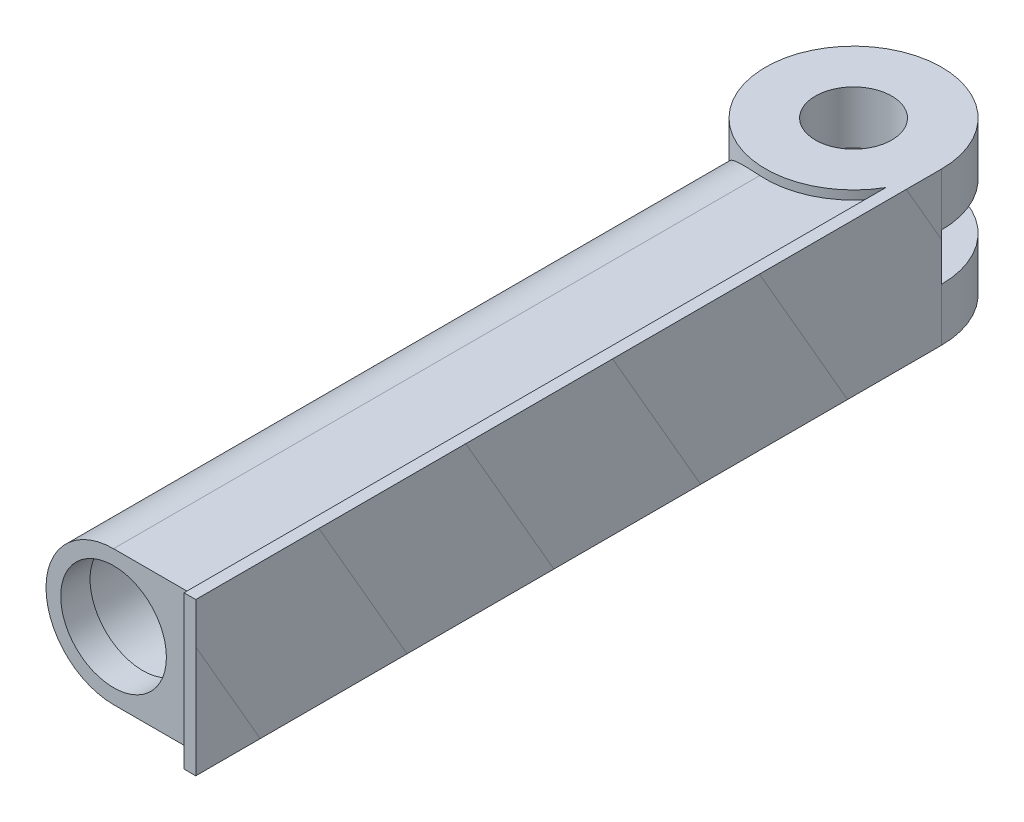
ISO-10303-21;
HEADER;
FILE_DESCRIPTION(('STEP AP214'),'2;1');
FILE_NAME('part.step','',(''),(''),'','','');
FILE_SCHEMA(('AUTOMOTIVE_DESIGN { 1 0 10303 214 1 1 1 1 }'));
ENDSEC;
DATA;
#1=APPLICATION_CONTEXT('core data for automotive mechanical design processes');
#2=APPLICATION_PROTOCOL_DEFINITION('international standard','automotive_design',2000,#1);
#3=PRODUCT_CONTEXT('',#1,'mechanical');
#4=PRODUCT('Part','Part','',(#3));
#5=PRODUCT_RELATED_PRODUCT_CATEGORY('part','',(#4));
#6=PRODUCT_DEFINITION_FORMATION('','',#4);
#7=PRODUCT_DEFINITION_CONTEXT('part definition',#1,'design');
#8=PRODUCT_DEFINITION('design','',#6,#7);
#9=PRODUCT_DEFINITION_SHAPE('','',#8);
#10=(LENGTH_UNIT() NAMED_UNIT(*) SI_UNIT(.MILLI.,.METRE.));
#11=(NAMED_UNIT(*) PLANE_ANGLE_UNIT() SI_UNIT($,.RADIAN.));
#12=(NAMED_UNIT(*) SI_UNIT($,.STERADIAN.) SOLID_ANGLE_UNIT());
#13=UNCERTAINTY_MEASURE_WITH_UNIT(LENGTH_MEASURE(1.E-05),#10,'distance_accuracy_value','');
#14=(GEOMETRIC_REPRESENTATION_CONTEXT(3) GLOBAL_UNCERTAINTY_ASSIGNED_CONTEXT((#13)) GLOBAL_UNIT_ASSIGNED_CONTEXT((#10,
#11,#12)) REPRESENTATION_CONTEXT('',''));
#15=CARTESIAN_POINT('',(0.,0.,0.));
#16=DIRECTION('',(0.,0.,1.));
#17=DIRECTION('',(1.,0.,0.));
#18=AXIS2_PLACEMENT_3D('',#15,#16,#17);
#19=CARTESIAN_POINT('',(30.,-59.0145476533858,250.));
#20=DIRECTION('',(1.,0.,0.));
#21=DIRECTION('',(0.,0.,-1.));
#22=AXIS2_PLACEMENT_3D('',#19,#20,#21);
#23=PLANE('',#22);
#24=DIRECTION('',(0.,-1.,0.));
#25=VECTOR('',#24,1.);
#26=CARTESIAN_POINT('',(30.,-59.0145476533858,0.));
#27=LINE('',#26,#25);
#28=CARTESIAN_POINT('',(30.,5.10608111236308,0.));
#29=VERTEX_POINT('',#28);
#30=CARTESIAN_POINT('',(30.,-8.,0.));
#31=VERTEX_POINT('',#30);
#32=EDGE_CURVE('E256',#29,#31,#27,.T.);
#33=ORIENTED_EDGE('',*,*,#32,.F.);
#34=DIRECTION('',(0.,0.866025403784436,0.500000000000004));
#35=VECTOR('',#34,1.);
#36=CARTESIAN_POINT('',(30.,65.2687850111071,34.7349532911159));
#37=LINE('',#36,#35);
#38=CARTESIAN_POINT('',(30.,26.,12.0631096942035));
#39=VERTEX_POINT('',#38);
#40=EDGE_CURVE('E47',#29,#39,#37,.T.);
#41=ORIENTED_EDGE('',*,*,#40,.T.);
#42=DIRECTION('',(0.,0.,-1.));
#43=VECTOR('',#42,1.);
#44=CARTESIAN_POINT('',(30.,26.,250.));
#45=LINE('',#44,#43);
#46=CARTESIAN_POINT('',(30.,26.,62.0631096942037));
#47=VERTEX_POINT('',#46);
#48=EDGE_CURVE('E338',#47,#39,#45,.T.);
#49=ORIENTED_EDGE('',*,*,#48,.F.);
#50=DIRECTION('',(0.,0.866025403784436,0.500000000000004));
#51=VECTOR('',#50,1.);
#52=CARTESIAN_POINT('',(30.,43.6181499164959,72.2349532911159));
#53=LINE('',#52,#51);
#54=CARTESIAN_POINT('',(30.,-26.,32.0408956963429));
#55=VERTEX_POINT('',#54);
#56=EDGE_CURVE('E296',#55,#47,#53,.T.);
#57=ORIENTED_EDGE('',*,*,#56,.F.);
#58=DIRECTION('',(0.,0.,-1.));
#59=VECTOR('',#58,1.);
#60=CARTESIAN_POINT('',(30.,-26.,250.));
#61=LINE('',#60,#59);
#62=CARTESIAN_POINT('',(30.,-26.,0.));
#63=VERTEX_POINT('',#62);
#64=EDGE_CURVE('E335',#55,#63,#61,.T.);
#65=ORIENTED_EDGE('',*,*,#64,.T.);
#66=EDGE_CURVE('E259',#31,#63,#27,.T.);
#67=ORIENTED_EDGE('',*,*,#66,.F.);
#68=EDGE_LOOP('',(#33,#41,#49,#57,#65,#67));
#69=FACE_BOUND('',#68,.T.);
#70=ADVANCED_FACE('F38',(#69),#23,.T.);
#71=CARTESIAN_POINT('',(30.,-26.,254.));
#72=VERTEX_POINT('',#71);
#73=CARTESIAN_POINT('',(30.,-26.,232.040895696344));
#74=VERTEX_POINT('',#73);
#75=EDGE_CURVE('E329',#72,#74,#61,.T.);
#76=ORIENTED_EDGE('',*,*,#75,.T.);
#77=DIRECTION('',(0.,0.866025403784436,0.500000000000004));
#78=VECTOR('',#77,1.);
#79=CARTESIAN_POINT('',(30.,-42.9843904619487,222.234953291116));
#80=LINE('',#79,#78);
#81=CARTESIAN_POINT('',(30.,12.0342843426371,254.));
#82=VERTEX_POINT('',#81);
#83=EDGE_CURVE('E312',#74,#82,#80,.T.);
#84=ORIENTED_EDGE('',*,*,#83,.T.);
#85=DIRECTION('',(0.,-1.,0.));
#86=VECTOR('',#85,1.);
#87=CARTESIAN_POINT('',(30.,26.,254.));
#88=LINE('',#87,#86);
#89=EDGE_CURVE('E179',#82,#72,#88,.T.);
#90=ORIENTED_EDGE('',*,*,#89,.T.);
#91=EDGE_LOOP('',(#76,#84,#90));
#92=FACE_BOUND('',#91,.T.);
#93=ADVANCED_FACE('F249',(#92),#23,.T.);
#94=ORIENTED_EDGE('',*,*,#83,.F.);
#95=CARTESIAN_POINT('',(30.,-26.,182.040895696343));
#96=VERTEX_POINT('',#95);
#97=EDGE_CURVE('E405',#74,#96,#61,.T.);
#98=ORIENTED_EDGE('',*,*,#97,.T.);
#99=DIRECTION('',(0.,0.866025403784436,0.500000000000004));
#100=VECTOR('',#99,1.);
#101=CARTESIAN_POINT('',(30.,-21.3337553673375,184.734953291116));
#102=LINE('',#101,#100);
#103=CARTESIAN_POINT('',(30.,26.,212.063109694204));
#104=VERTEX_POINT('',#103);
#105=EDGE_CURVE('E309',#96,#104,#102,.T.);
#106=ORIENTED_EDGE('',*,*,#105,.T.);
#107=CARTESIAN_POINT('',(30.,26.,254.));
#108=VERTEX_POINT('',#107);
#109=EDGE_CURVE('E332',#108,#104,#45,.T.);
#110=ORIENTED_EDGE('',*,*,#109,.F.);
#111=EDGE_CURVE('E174',#108,#82,#88,.T.);
#112=ORIENTED_EDGE('',*,*,#111,.T.);
#113=EDGE_LOOP('',(#94,#98,#106,#110,#112));
#114=FACE_BOUND('',#113,.T.);
#115=ADVANCED_FACE('F253',(#114),#23,.T.);
#116=ORIENTED_EDGE('',*,*,#105,.F.);
#117=CARTESIAN_POINT('',(30.,-26.,132.040895696343));
#118=VERTEX_POINT('',#117);
#119=EDGE_CURVE('E406',#96,#118,#61,.T.);
#120=ORIENTED_EDGE('',*,*,#119,.T.);
#121=DIRECTION('',(0.,0.866025403784436,0.500000000000004));
#122=VECTOR('',#121,1.);
#123=CARTESIAN_POINT('',(30.,0.316879727273629,147.234953291116));
#124=LINE('',#123,#122);
#125=CARTESIAN_POINT('',(30.,26.,162.063109694204));
#126=VERTEX_POINT('',#125);
#127=EDGE_CURVE('E305',#118,#126,#124,.T.);
#128=ORIENTED_EDGE('',*,*,#127,.T.);
#129=EDGE_CURVE('E336',#104,#126,#45,.T.);
#130=ORIENTED_EDGE('',*,*,#129,.F.);
#131=EDGE_LOOP('',(#116,#120,#128,#130));
#132=FACE_BOUND('',#131,.T.);
#133=ADVANCED_FACE('F409',(#132),#23,.T.);
#134=ORIENTED_EDGE('',*,*,#127,.F.);
#135=CARTESIAN_POINT('',(30.,-26.,82.040895696343));
#136=VERTEX_POINT('',#135);
#137=EDGE_CURVE('E351',#118,#136,#61,.T.);
#138=ORIENTED_EDGE('',*,*,#137,.T.);
#139=DIRECTION('',(0.,0.866025403784436,0.500000000000004));
#140=VECTOR('',#139,1.);
#141=CARTESIAN_POINT('',(30.,21.9675148218848,109.734953291116));
#142=LINE('',#141,#140);
#143=CARTESIAN_POINT('',(30.,26.,112.063109694204));
#144=VERTEX_POINT('',#143);
#145=EDGE_CURVE('E300',#136,#144,#142,.T.);
#146=ORIENTED_EDGE('',*,*,#145,.T.);
#147=EDGE_CURVE('E341',#126,#144,#45,.T.);
#148=ORIENTED_EDGE('',*,*,#147,.F.);
#149=EDGE_LOOP('',(#134,#138,#146,#148));
#150=FACE_BOUND('',#149,.T.);
#151=ADVANCED_FACE('F349',(#150),#23,.T.);
#152=ORIENTED_EDGE('',*,*,#145,.F.);
#153=EDGE_CURVE('E339',#136,#55,#61,.T.);
#154=ORIENTED_EDGE('',*,*,#153,.T.);
#155=ORIENTED_EDGE('',*,*,#56,.T.);
#156=EDGE_CURVE('E343',#144,#47,#45,.T.);
#157=ORIENTED_EDGE('',*,*,#156,.F.);
#158=EDGE_LOOP('',(#152,#154,#155,#157));
#159=FACE_BOUND('',#158,.T.);
#160=ADVANCED_FACE('F239',(#159),#23,.T.);
#161=CARTESIAN_POINT('',(0.,26.,0.));
#162=DIRECTION('',(0.,-1.,0.));
#163=DIRECTION('',(0.,0.,-1.));
#164=AXIS2_PLACEMENT_3D('',#161,#162,#163);
#165=CYLINDRICAL_SURFACE('',#164,30.);
#166=CARTESIAN_POINT('',(0.,-8.,0.));
#167=DIRECTION('',(0.,1.,0.));
#168=DIRECTION('',(0.,0.,1.));
#169=AXIS2_PLACEMENT_3D('',#166,#167,#168);
#170=CIRCLE('',#169,30.);
#171=CARTESIAN_POINT('',(-23.5638586528478,-8.,18.5672982791953));
#172=VERTEX_POINT('',#171);
#173=EDGE_CURVE('E196',#31,#172,#170,.T.);
#174=ORIENTED_EDGE('',*,*,#173,.F.);
#175=ORIENTED_EDGE('',*,*,#66,.T.);
#176=CARTESIAN_POINT('',(0.,-26.,0.));
#177=DIRECTION('',(0.,1.,0.));
#178=DIRECTION('',(0.,0.,1.));
#179=AXIS2_PLACEMENT_3D('',#176,#177,#178);
#180=CIRCLE('',#179,30.);
#181=CARTESIAN_POINT('',(26.,-26.,14.9666295470958));
#182=VERTEX_POINT('',#181);
#183=EDGE_CURVE('E358',#63,#182,#180,.T.);
#184=ORIENTED_EDGE('',*,*,#183,.T.);
#185=DIRECTION('',(0.,-1.,0.));
#186=VECTOR('',#185,1.);
#187=CARTESIAN_POINT('',(26.,26.,14.9666295470958));
#188=LINE('',#187,#186);
#189=CARTESIAN_POINT('',(26.,-23.,14.9666295470958));
#190=VERTEX_POINT('',#189);
#191=EDGE_CURVE('E363',#182,#190,#188,.F.);
#192=ORIENTED_EDGE('',*,*,#191,.T.);
#193=CARTESIAN_POINT('',(0.,-23.,0.));
#194=DIRECTION('',(0.,-1.,0.));
#195=DIRECTION('',(1.,0.,0.));
#196=AXIS2_PLACEMENT_3D('',#193,#194,#195);
#197=CIRCLE('',#196,30.);
#198=CARTESIAN_POINT('',(-2.,-23.,29.9332590941915));
#199=VERTEX_POINT('',#198);
#200=EDGE_CURVE('E376',#190,#199,#197,.T.);
#201=ORIENTED_EDGE('',*,*,#200,.T.);
#202=CARTESIAN_POINT('',(-2.,23.,29.9332590941915));
#203=CARTESIAN_POINT('',(-2.28679083144388,23.0000081452286,29.9141059027481));
#204=CARTESIAN_POINT('',(-2.57329736348321,22.994636127076,29.8908142516939));
#205=CARTESIAN_POINT('',(-3.14511235421239,22.9732555806749,29.8360623644422));
#206=CARTESIAN_POINT('',(-3.43042089070386,22.9572477542467,29.8046026673091));
#207=CARTESIAN_POINT('',(-3.99901914483186,22.9147365183909,29.7336490771329));
#208=CARTESIAN_POINT('',(-4.2823103045063,22.8882415802645,29.6941616812124));
#209=CARTESIAN_POINT('',(-4.84650393259821,22.8249432193334,29.6073117458914));
#210=CARTESIAN_POINT('',(-5.12740637288096,22.7881396752851,29.5599491138698));
#211=CARTESIAN_POINT('',(-5.96138889157076,22.663219842366,29.4071305964964));
#212=CARTESIAN_POINT('',(-6.51028527414877,22.5602486465625,29.2903727326244));
#213=CARTESIAN_POINT('',(-7.59270409489469,22.3165784015619,29.0286266668642));
#214=CARTESIAN_POINT('',(-8.12622396553718,22.1758730915904,28.8836337813677));
#215=CARTESIAN_POINT('',(-9.17315697468753,21.8596406401281,28.5683585434961));
#216=CARTESIAN_POINT('',(-9.68662756188296,21.6842233192194,28.3981563639096));
#217=CARTESIAN_POINT('',(-10.6927774223399,21.3008332976824,28.0348114163219));
#218=CARTESIAN_POINT('',(-11.1854576281338,21.0928620592034,27.8416696787379));
#219=CARTESIAN_POINT('',(-12.149089039865,20.6465115105614,27.4348979845477));
#220=CARTESIAN_POINT('',(-12.6200040514078,20.408083867148,27.2212355991099));
#221=CARTESIAN_POINT('',(-13.5381822333182,19.9033882045849,26.7764429649269));
#222=CARTESIAN_POINT('',(-13.9854404577854,19.6371143980385,26.5453090877787));
#223=CARTESIAN_POINT('',(-14.7202138829557,19.1656742809685,26.1425370001605));
#224=CARTESIAN_POINT('',(-15.0141856900843,18.9672262183516,25.9747256680437));
#225=CARTESIAN_POINT('',(-15.590266477814,18.5588064103901,25.6330984238406));
#226=CARTESIAN_POINT('',(-15.8723778614858,18.348837019479,25.4592837412354));
#227=CARTESIAN_POINT('',(-16.7010711655419,17.7022504079188,24.9299780342301));
#228=CARTESIAN_POINT('',(-17.2298927551427,17.2490318003376,24.5666915037458));
#229=CARTESIAN_POINT('',(-18.2411302299155,16.3005541744178,23.8255241272234));
#230=CARTESIAN_POINT('',(-18.7233864691815,15.8051607729077,23.4475988933507));
#231=CARTESIAN_POINT('',(-19.6394398318546,14.775816461762,22.6858332170939));
#232=CARTESIAN_POINT('',(-20.0732444032594,14.241871499112,22.3019936942068));
#233=CARTESIAN_POINT('',(-20.8992742621,13.1265960121457,21.5301042330049));
#234=CARTESIAN_POINT('',(-21.2906433796254,12.5446019496891,21.1420974630519));
#235=CARTESIAN_POINT('',(-22.0222348034672,11.3404898265095,20.3789162895879));
#236=CARTESIAN_POINT('',(-22.3624305675762,10.7183511813054,20.0037486227589));
#237=CARTESIAN_POINT('',(-22.8315801479544,9.75560271211078,19.4621672666968));
#238=CARTESIAN_POINT('',(-22.9808278556616,9.43049653110492,19.2855271505878));
#239=CARTESIAN_POINT('',(-23.2655347349754,8.76963665161037,18.9410859236605));
#240=CARTESIAN_POINT('',(-23.4009927734511,8.43388208108567,18.7732855397705));
#241=CARTESIAN_POINT('',(-23.6573253536555,7.75195247554772,18.4492169964599));
#242=CARTESIAN_POINT('',(-23.7782176609925,7.40579079159011,18.2929348806424));
#243=CARTESIAN_POINT('',(-24.0048170134505,6.70257108018733,17.9945505283131));
#244=CARTESIAN_POINT('',(-24.1105264133691,6.34551475288781,17.8524460939556));
#245=CARTESIAN_POINT('',(-24.3048843604272,5.62408420869242,17.586910584602));
#246=CARTESIAN_POINT('',(-24.3936873145171,5.25981349423123,17.4633129545921));
#247=CARTESIAN_POINT('',(-24.5543938808827,4.52129057785824,17.2366200036426));
#248=CARTESIAN_POINT('',(-24.6263000736953,4.14703990985646,17.1335215523618));
#249=CARTESIAN_POINT('',(-24.7519442846429,3.39052865533896,16.951504250353));
#250=CARTESIAN_POINT('',(-24.8057218508538,3.00828746205883,16.872532801694));
#251=CARTESIAN_POINT('',(-24.8942486038202,2.23696757885319,16.7416448148667));
#252=CARTESIAN_POINT('',(-24.9289980711249,1.84788898982511,16.689727877809));
#253=CARTESIAN_POINT('',(-24.9788445057734,1.06243734746683,16.6150352961426));
#254=CARTESIAN_POINT('',(-24.9937791733523,0.666030696158006,16.5925003401072));
#255=CARTESIAN_POINT('',(-25.0030691168933,-0.127563088467266,16.5784984546488));
#256=CARTESIAN_POINT('',(-24.9974252177066,-0.524750189863104,16.5870302799752));
#257=CARTESIAN_POINT('',(-24.965696579371,-1.31683468565722,16.6347466178501));
#258=CARTESIAN_POINT('',(-24.9395911938079,-1.71172936123302,16.6739620912911));
#259=CARTESIAN_POINT('',(-24.8675822112135,-2.4957478725326,16.7811642345171));
#260=CARTESIAN_POINT('',(-24.8216755933422,-2.88487081835871,16.8491552942234));
#261=CARTESIAN_POINT('',(-24.6994348442601,-3.73594347553646,17.0279762525158));
#262=CARTESIAN_POINT('',(-24.618732354003,-4.19600153006437,17.1448078256587));
#263=CARTESIAN_POINT('',(-24.4318586624414,-5.10153842374338,17.4100691224308));
#264=CARTESIAN_POINT('',(-24.3256802829178,-5.54701311353408,17.558507750499));
#265=CARTESIAN_POINT('',(-24.0895313214742,-6.42332437947345,17.8811209900961));
#266=CARTESIAN_POINT('',(-23.9594998216213,-6.85412004850627,18.0553612710873));
#267=CARTESIAN_POINT('',(-23.6774966396757,-7.69966089803098,18.4236267653892));
#268=CARTESIAN_POINT('',(-23.5255237709275,-8.11440520887764,18.6176530486198));
#269=CARTESIAN_POINT('',(-23.1054401546408,-9.16759500906189,19.1391473062025));
#270=CARTESIAN_POINT('',(-22.8215875982236,-9.79416643075573,19.47799018844));
#271=CARTESIAN_POINT('',(-22.2051380960972,-11.0098663265877,20.1779548106749));
#272=CARTESIAN_POINT('',(-21.8725138565129,-11.598973568413,20.5390889594765));
#273=CARTESIAN_POINT('',(-21.1598978392406,-12.7417502829072,21.2725307681793));
#274=CARTESIAN_POINT('',(-20.7798452464158,-13.2953728502877,21.6448522991896));
#275=CARTESIAN_POINT('',(-19.9736035834098,-14.3665865736035,22.391001371462));
#276=CARTESIAN_POINT('',(-19.547423662155,-14.8841848412834,22.7648285999733));
#277=CARTESIAN_POINT('',(-18.6313389691013,-15.9023850470849,23.5210506380617));
#278=CARTESIAN_POINT('',(-18.1395811622769,-16.4015064081352,23.903200009283));
#279=CARTESIAN_POINT('',(-17.1064240141842,-17.3577465529496,24.6531499272605));
#280=CARTESIAN_POINT('',(-16.5650165343798,-17.8148584258755,25.0209481074447));
#281=CARTESIAN_POINT('',(-15.434136588819,-18.6823664883429,25.7338960051859));
#282=CARTESIAN_POINT('',(-14.8447606868686,-19.0928527321119,26.0790888176397));
#283=CARTESIAN_POINT('',(-13.6182990585319,-19.8630031601987,26.7399818890626));
#284=CARTESIAN_POINT('',(-12.9812346078117,-20.2226898038137,27.0556951603446));
#285=CARTESIAN_POINT('',(-11.844380403113,-20.7935916348503,27.5678225593886));
#286=CARTESIAN_POINT('',(-11.3553358022372,-21.0183611250717,27.7730867856233));
#287=CARTESIAN_POINT('',(-10.355057070085,-21.4356373241317,28.1613287503515));
#288=CARTESIAN_POINT('',(-9.84382434069455,-21.6281460675369,28.3443078940842));
#289=CARTESIAN_POINT('',(-8.80242570928346,-21.9779012258769,28.6847843317827));
#290=CARTESIAN_POINT('',(-8.27229993284458,-22.1352177476881,28.8423321102869));
#291=CARTESIAN_POINT('',(-7.19509107361308,-22.4124976108349,29.1297285364554));
#292=CARTESIAN_POINT('',(-6.6480133974924,-22.5324727297835,29.2595859136947));
#293=CARTESIAN_POINT('',(-5.76056952421719,-22.6930232781488,29.4437127155882));
#294=CARTESIAN_POINT('',(-5.42439031696846,-22.7462093379841,29.5075205917298));
#295=CARTESIAN_POINT('',(-4.74814296806899,-22.8377772457889,29.6238548919525));
#296=CARTESIAN_POINT('',(-4.40807578954609,-22.8761626817164,29.6763840488436));
#297=CARTESIAN_POINT('',(-3.72442336100672,-22.9378357351282,29.7699148912142));
#298=CARTESIAN_POINT('',(-3.38083323160709,-22.9610983341781,29.8108974114111));
#299=CARTESIAN_POINT('',(-2.69163533190127,-22.9921918006083,29.8810210178246));
#300=CARTESIAN_POINT('',(-2.34602691537153,-23.00001741899,29.9101580735845));
#301=CARTESIAN_POINT('',(-2.00000000000001,-23.,29.9332590941915));
#302=B_SPLINE_CURVE_WITH_KNOTS('',3,(#202,#203,#204,#205,#206,#207,#208,#209,#210,#211,#212,
#213,#214,#215,#216,#217,#218,#219,#220,#221,#222,#223,#224,#225,#226,#227,#228,#229,#230,#231,
#232,#233,#234,#235,#236,#237,#238,#239,#240,#241,#242,#243,#244,#245,#246,#247,#248,#249,#250,
#251,#252,#253,#254,#255,#256,#257,#258,#259,#260,#261,#262,#263,#264,#265,#266,#267,#268,#269,
#270,#271,#272,#273,#274,#275,#276,#277,#278,#279,#280,#281,#282,#283,#284,#285,#286,#287,#288,
#289,#290,#291,#292,#293,#294,#295,#296,#297,#298,#299,#300,#301),.UNSPECIFIED.,.F.,.F.,(4,2,2,
2,2,2,2,2,2,2,2,2,2,2,2,2,2,2,2,2,2,2,2,2,2,2,2,2,2,2,2,2,2,2,2,2,2,2,2,2,2,2,2,2,2,2,2,2,2,4),
(0.,0.862196041227084,1.72433519476817,2.58577934435102,3.44723362614836,5.15642343536861,
6.86589700583361,8.5700462709422,10.2741190166578,11.980930468241,13.6880973619966,
14.8648517421035,16.0413665364926,18.3948649184123,20.756165131259,23.1171018636538,
25.5191751925232,27.9224901462184,29.1189930603758,30.3155942148938,31.5107207922029,
32.7056618103702,33.889102377934,35.072362088363,36.2530235244537,37.4336675524771,
38.6239235370374,39.8141318130554,41.0055426027669,42.1971352162636,43.6392900965355,
45.0818518040478,46.5281502667479,47.9745269789516,50.271455378873,52.5696741394003,
54.8708706743076,57.1716116218095,59.5632969775579,61.955375079689,64.3427515277181,
66.7290691528455,68.4556077329534,70.1820373856055,71.9049965466893,73.6274117282603,
74.6658232564533,75.7039828950684,76.7438556695833,77.7840819685827),.UNSPECIFIED.);
#303=EDGE_CURVE('E368',#172,#199,#302,.T.);
#304=ORIENTED_EDGE('',*,*,#303,.F.);
#305=EDGE_LOOP('',(#174,#175,#184,#192,#201,#304));
#306=FACE_BOUND('',#305,.T.);
#307=ADVANCED_FACE('F437',(#306),#165,.T.);
#308=CARTESIAN_POINT('',(0.,-26.,0.));
#309=DIRECTION('',(0.,1.,0.));
#310=DIRECTION('',(0.,0.,1.));
#311=AXIS2_PLACEMENT_3D('',#308,#309,#310);
#312=CYLINDRICAL_SURFACE('',#311,13.);
#313=CARTESIAN_POINT('',(0.,-26.,0.));
#314=DIRECTION('',(0.,1.,0.));
#315=DIRECTION('',(0.,0.,1.));
#316=AXIS2_PLACEMENT_3D('',#313,#314,#315);
#317=CIRCLE('',#316,13.);
#318=CARTESIAN_POINT('',(0.,-26.,13.));
#319=VERTEX_POINT('',#318);
#320=EDGE_CURVE('E211',#319,#319,#317,.T.);
#321=ORIENTED_EDGE('',*,*,#320,.F.);
#322=EDGE_LOOP('',(#321));
#323=FACE_BOUND('',#322,.T.);
#324=CARTESIAN_POINT('',(0.,-8.,0.));
#325=DIRECTION('',(0.,1.,0.));
#326=DIRECTION('',(0.,0.,1.));
#327=AXIS2_PLACEMENT_3D('',#324,#325,#326);
#328=CIRCLE('',#327,13.);
#329=CARTESIAN_POINT('',(0.,-8.,13.));
#330=VERTEX_POINT('',#329);
#331=EDGE_CURVE('E199',#330,#330,#328,.F.);
#332=ORIENTED_EDGE('',*,*,#331,.F.);
#333=EDGE_LOOP('',(#332));
#334=FACE_BOUND('',#333,.T.);
#335=ADVANCED_FACE('F230',(#323,#334),#312,.F.);
#336=CARTESIAN_POINT('',(30.,26.,0.));
#337=VERTEX_POINT('',#336);
#338=CARTESIAN_POINT('',(30.,8.,0.));
#339=VERTEX_POINT('',#338);
#340=EDGE_CURVE('E263',#337,#339,#27,.T.);
#341=ORIENTED_EDGE('',*,*,#340,.T.);
#342=CARTESIAN_POINT('',(0.,8.,0.));
#343=DIRECTION('',(0.,1.,0.));
#344=DIRECTION('',(0.,0.,1.));
#345=AXIS2_PLACEMENT_3D('',#342,#343,#344);
#346=CIRCLE('',#345,30.);
#347=CARTESIAN_POINT('',(-23.5638586528478,8.,18.5672982791953));
#348=VERTEX_POINT('',#347);
#349=EDGE_CURVE('E192',#339,#348,#346,.T.);
#350=ORIENTED_EDGE('',*,*,#349,.T.);
#351=CARTESIAN_POINT('',(-2.,23.,29.9332590941915));
#352=VERTEX_POINT('',#351);
#353=EDGE_CURVE('E369',#352,#348,#302,.T.);
#354=ORIENTED_EDGE('',*,*,#353,.F.);
#355=CARTESIAN_POINT('',(0.,23.,0.));
#356=DIRECTION('',(0.,-1.,0.));
#357=DIRECTION('',(1.,0.,0.));
#358=AXIS2_PLACEMENT_3D('',#355,#356,#357);
#359=CIRCLE('',#358,30.);
#360=CARTESIAN_POINT('',(26.,23.,14.9666295470958));
#361=VERTEX_POINT('',#360);
#362=EDGE_CURVE('E361',#361,#352,#359,.T.);
#363=ORIENTED_EDGE('',*,*,#362,.F.);
#364=DIRECTION('',(0.,-1.,0.));
#365=VECTOR('',#364,1.);
#366=CARTESIAN_POINT('',(26.,26.,14.9666295470958));
#367=LINE('',#366,#365);
#368=CARTESIAN_POINT('',(26.,26.,14.9666295470958));
#369=VERTEX_POINT('',#368);
#370=EDGE_CURVE('E359',#369,#361,#367,.T.);
#371=ORIENTED_EDGE('',*,*,#370,.F.);
#372=CARTESIAN_POINT('',(0.,26.,0.));
#373=DIRECTION('',(0.,1.,0.));
#374=DIRECTION('',(0.,0.,1.));
#375=AXIS2_PLACEMENT_3D('',#372,#373,#374);
#376=CIRCLE('',#375,30.);
#377=EDGE_CURVE('E158',#337,#369,#376,.T.);
#378=ORIENTED_EDGE('',*,*,#377,.F.);
#379=EDGE_LOOP('',(#341,#350,#354,#363,#371,#378));
#380=FACE_BOUND('',#379,.T.);
#381=ADVANCED_FACE('F40',(#380),#165,.T.);
#382=CARTESIAN_POINT('',(0.,26.,0.));
#383=DIRECTION('',(0.,1.,0.));
#384=DIRECTION('',(0.,0.,1.));
#385=AXIS2_PLACEMENT_3D('',#382,#383,#384);
#386=PLANE('',#385);
#387=CARTESIAN_POINT('',(0.,26.,0.));
#388=DIRECTION('',(0.,1.,0.));
#389=DIRECTION('',(0.,0.,1.));
#390=AXIS2_PLACEMENT_3D('',#387,#388,#389);
#391=CIRCLE('',#390,13.);
#392=CARTESIAN_POINT('',(0.,26.,13.));
#393=VERTEX_POINT('',#392);
#394=EDGE_CURVE('E210',#393,#393,#391,.T.);
#395=ORIENTED_EDGE('',*,*,#394,.F.);
#396=EDGE_LOOP('',(#395));
#397=FACE_BOUND('',#396,.T.);
#398=ORIENTED_EDGE('',*,*,#377,.T.);
#399=DIRECTION('',(0.,0.,-1.));
#400=VECTOR('',#399,1.);
#401=CARTESIAN_POINT('',(26.,26.,250.));
#402=LINE('',#401,#400);
#403=CARTESIAN_POINT('',(26.,26.,254.));
#404=VERTEX_POINT('',#403);
#405=EDGE_CURVE('E150',#404,#369,#402,.T.);
#406=ORIENTED_EDGE('',*,*,#405,.F.);
#407=DIRECTION('',(1.,0.,0.));
#408=VECTOR('',#407,1.);
#409=CARTESIAN_POINT('',(26.,26.,254.));
#410=LINE('',#409,#408);
#411=EDGE_CURVE('E155',#404,#108,#410,.T.);
#412=ORIENTED_EDGE('',*,*,#411,.T.);
#413=ORIENTED_EDGE('',*,*,#109,.T.);
#414=ORIENTED_EDGE('',*,*,#129,.T.);
#415=ORIENTED_EDGE('',*,*,#147,.T.);
#416=ORIENTED_EDGE('',*,*,#156,.T.);
#417=ORIENTED_EDGE('',*,*,#48,.T.);
#418=EDGE_CURVE('E161',#39,#337,#45,.T.);
#419=ORIENTED_EDGE('',*,*,#418,.T.);
#420=EDGE_LOOP('',(#398,#406,#412,#413,#414,#415,#416,#417,#419));
#421=FACE_BOUND('',#420,.T.);
#422=ADVANCED_FACE('F152',(#397,#421),#386,.T.);
#423=CARTESIAN_POINT('',(0.,-26.,0.));
#424=DIRECTION('',(0.,1.,0.));
#425=DIRECTION('',(0.,0.,1.));
#426=AXIS2_PLACEMENT_3D('',#423,#424,#425);
#427=PLANE('',#426);
#428=ORIENTED_EDGE('',*,*,#320,.T.);
#429=EDGE_LOOP('',(#428));
#430=FACE_BOUND('',#429,.T.);
#431=ORIENTED_EDGE('',*,*,#183,.F.);
#432=ORIENTED_EDGE('',*,*,#64,.F.);
#433=ORIENTED_EDGE('',*,*,#153,.F.);
#434=ORIENTED_EDGE('',*,*,#137,.F.);
#435=ORIENTED_EDGE('',*,*,#119,.F.);
#436=ORIENTED_EDGE('',*,*,#97,.F.);
#437=ORIENTED_EDGE('',*,*,#75,.F.);
#438=DIRECTION('',(1.,0.,0.));
#439=VECTOR('',#438,1.);
#440=CARTESIAN_POINT('',(26.,-26.,254.));
#441=LINE('',#440,#439);
#442=CARTESIAN_POINT('',(26.,-26.,254.));
#443=VERTEX_POINT('',#442);
#444=EDGE_CURVE('E180',#443,#72,#441,.T.);
#445=ORIENTED_EDGE('',*,*,#444,.F.);
#446=DIRECTION('',(0.,0.,-1.));
#447=VECTOR('',#446,1.);
#448=CARTESIAN_POINT('',(26.,-26.,250.));
#449=LINE('',#448,#447);
#450=EDGE_CURVE('E169',#443,#182,#449,.T.);
#451=ORIENTED_EDGE('',*,*,#450,.T.);
#452=EDGE_LOOP('',(#431,#432,#433,#434,#435,#436,#437,#445,#451));
#453=FACE_BOUND('',#452,.T.);
#454=ADVANCED_FACE('F357',(#430,#453),#427,.F.);
#455=CARTESIAN_POINT('',(2.49999999999999,23.,250.));
#456=DIRECTION('',(0.,-1.,0.));
#457=DIRECTION('',(1.,0.,0.));
#458=AXIS2_PLACEMENT_3D('',#455,#456,#457);
#459=PLANE('',#458);
#460=DIRECTION('',(0.,0.,-1.));
#461=VECTOR('',#460,1.);
#462=CARTESIAN_POINT('',(26.,23.,250.));
#463=LINE('',#462,#461);
#464=CARTESIAN_POINT('',(26.,23.,250.));
#465=VERTEX_POINT('',#464);
#466=EDGE_CURVE('E162',#465,#361,#463,.T.);
#467=ORIENTED_EDGE('',*,*,#466,.T.);
#468=ORIENTED_EDGE('',*,*,#362,.T.);
#469=DIRECTION('',(0.,0.,-1.));
#470=VECTOR('',#469,1.);
#471=CARTESIAN_POINT('',(-2.,23.,250.));
#472=LINE('',#471,#470);
#473=CARTESIAN_POINT('',(-2.,23.,250.));
#474=VERTEX_POINT('',#473);
#475=EDGE_CURVE('E399',#474,#352,#472,.T.);
#476=ORIENTED_EDGE('',*,*,#475,.F.);
#477=DIRECTION('',(-1.,0.,0.));
#478=VECTOR('',#477,1.);
#479=CARTESIAN_POINT('',(2.49999999999999,23.,250.));
#480=LINE('',#479,#478);
#481=EDGE_CURVE('E269',#465,#474,#480,.T.);
#482=ORIENTED_EDGE('',*,*,#481,.F.);
#483=EDGE_LOOP('',(#467,#468,#476,#482));
#484=FACE_BOUND('',#483,.T.);
#485=ADVANCED_FACE('F245',(#484),#459,.F.);
#486=CARTESIAN_POINT('',(-2.,0.,250.));
#487=DIRECTION('',(0.,0.,-1.));
#488=DIRECTION('',(-1.,0.,0.));
#489=AXIS2_PLACEMENT_3D('',#486,#487,#488);
#490=CYLINDRICAL_SURFACE('',#489,23.);
#491=ORIENTED_EDGE('',*,*,#475,.T.);
#492=ORIENTED_EDGE('',*,*,#353,.T.);
#493=CARTESIAN_POINT('',(-23.5638586528478,8.,18.5672982791953));
#494=CARTESIAN_POINT('',(-23.7035732751594,7.6233513483435,18.3900267227702));
#495=CARTESIAN_POINT('',(-23.8345892379411,7.23998316040782,18.2195933827132));
#496=CARTESIAN_POINT('',(-24.0782197920642,6.45911188796541,17.896368872161));
#497=CARTESIAN_POINT('',(-24.1907915531884,6.06157844235039,17.7436189998972));
#498=CARTESIAN_POINT('',(-24.3964694170673,5.25107655438201,17.4597625698586));
#499=CARTESIAN_POINT('',(-24.4894594728497,4.83803229639433,17.3287859595242));
#500=CARTESIAN_POINT('',(-24.6534729973941,4.00027343059111,17.0946390340114));
#501=CARTESIAN_POINT('',(-24.7245189194307,3.57557123908528,16.9914403104477));
#502=CARTESIAN_POINT('',(-24.8549577362344,2.63076571847581,16.8002156590529));
#503=CARTESIAN_POINT('',(-24.9092342100943,2.10846669867749,16.7192733228473));
#504=CARTESIAN_POINT('',(-24.9816941620492,1.0573977363502,16.6108221588757));
#505=CARTESIAN_POINT('',(-24.9999924097481,0.528653801854821,16.5831434276332));
#506=CARTESIAN_POINT('',(-25.0000062977754,-0.438634045839457,16.5831077922912));
#507=CARTESIAN_POINT('',(-24.9874206953802,-0.877206041355392,16.6021331890547));
#508=CARTESIAN_POINT('',(-24.9374964072093,-1.74995766114685,16.6770292448917));
#509=CARTESIAN_POINT('',(-24.9001455849167,-2.18413502580732,16.7329179692461));
#510=CARTESIAN_POINT('',(-24.8015286641658,-3.04625478216616,16.8787403671762));
#511=CARTESIAN_POINT('',(-24.7401364280578,-3.47415173147006,16.9688535290239));
#512=CARTESIAN_POINT('',(-24.5949374942904,-4.31886261032829,17.1786278009331));
#513=CARTESIAN_POINT('',(-24.511121443316,-4.73567183507839,17.2983012394344));
#514=CARTESIAN_POINT('',(-24.3598300050688,-5.39473550996068,17.5102349903916));
#515=CARTESIAN_POINT('',(-24.2989224212497,-5.64107697671036,17.5947255047255));
#516=CARTESIAN_POINT('',(-24.1698208063592,-6.1288370325321,17.7716558474126));
#517=CARTESIAN_POINT('',(-24.1016297526149,-6.37025758547375,17.8640924245916));
#518=CARTESIAN_POINT('',(-23.9589525142893,-6.84583472102669,18.0549893264745));
#519=CARTESIAN_POINT('',(-23.8845347180066,-7.08003935317548,18.153381589963));
#520=CARTESIAN_POINT('',(-23.7290906549633,-7.54362919586252,18.3561059283963));
#521=CARTESIAN_POINT('',(-23.6480646320656,-7.77301458385252,18.4604377841098));
#522=CARTESIAN_POINT('',(-23.5638586528478,-8.,18.5672982791953));
#523=B_SPLINE_CURVE_WITH_KNOTS('',3,(#493,#494,#495,#496,#497,#498,#499,#500,#501,#502,#503,
#504,#505,#506,#507,#508,#509,#510,#511,#512,#513,#514,#515,#516,#517,#518,#519,#520,#521,#522),
.UNSPECIFIED.,.F.,.F.,(4,2,2,2,2,2,2,2,2,2,2,2,2,2,4),(0.,1.31746428707601,2.63794584581134,
3.96604545647474,5.29278161693966,6.88300555831719,8.46814844334508,9.78337143891215,
11.0992394534005,12.4221059553052,13.7455251076157,14.5476567465208,15.3494617370178,
16.1433936025366,16.9372961828839),.UNSPECIFIED.);
#524=EDGE_CURVE('E201',#348,#172,#523,.T.);
#525=ORIENTED_EDGE('',*,*,#524,.T.);
#526=ORIENTED_EDGE('',*,*,#303,.T.);
#527=DIRECTION('',(0.,0.,-1.));
#528=VECTOR('',#527,1.);
#529=CARTESIAN_POINT('',(-2.,-23.,250.));
#530=LINE('',#529,#528);
#531=CARTESIAN_POINT('',(-2.,-23.,250.));
#532=VERTEX_POINT('',#531);
#533=EDGE_CURVE('E389',#532,#199,#530,.T.);
#534=ORIENTED_EDGE('',*,*,#533,.F.);
#535=CARTESIAN_POINT('',(-2.,0.,250.));
#536=DIRECTION('',(0.,0.,1.));
#537=DIRECTION('',(1.,0.,0.));
#538=AXIS2_PLACEMENT_3D('',#535,#536,#537);
#539=CIRCLE('',#538,23.);
#540=EDGE_CURVE('E280',#474,#532,#539,.T.);
#541=ORIENTED_EDGE('',*,*,#540,.F.);
#542=EDGE_LOOP('',(#491,#492,#525,#526,#534,#541));
#543=FACE_BOUND('',#542,.T.);
#544=ADVANCED_FACE('F213',(#543),#490,.T.);
#545=CARTESIAN_POINT('',(2.5,-23.,250.));
#546=DIRECTION('',(0.,-1.,0.));
#547=DIRECTION('',(1.,0.,0.));
#548=AXIS2_PLACEMENT_3D('',#545,#546,#547);
#549=PLANE('',#548);
#550=ORIENTED_EDGE('',*,*,#200,.F.);
#551=DIRECTION('',(0.,0.,-1.));
#552=VECTOR('',#551,1.);
#553=CARTESIAN_POINT('',(26.,-23.,250.));
#554=LINE('',#553,#552);
#555=CARTESIAN_POINT('',(26.,-23.,250.));
#556=VERTEX_POINT('',#555);
#557=EDGE_CURVE('E386',#556,#190,#554,.T.);
#558=ORIENTED_EDGE('',*,*,#557,.F.);
#559=DIRECTION('',(-1.,0.,0.));
#560=VECTOR('',#559,1.);
#561=CARTESIAN_POINT('',(2.5,-23.,250.));
#562=LINE('',#561,#560);
#563=EDGE_CURVE('E281',#556,#532,#562,.T.);
#564=ORIENTED_EDGE('',*,*,#563,.T.);
#565=ORIENTED_EDGE('',*,*,#533,.T.);
#566=EDGE_LOOP('',(#550,#558,#564,#565));
#567=FACE_BOUND('',#566,.T.);
#568=ADVANCED_FACE('F237',(#567),#549,.T.);
#569=CARTESIAN_POINT('',(26.,-59.0145476533858,250.));
#570=DIRECTION('',(1.,0.,0.));
#571=DIRECTION('',(0.,0.,-1.));
#572=AXIS2_PLACEMENT_3D('',#569,#570,#571);
#573=PLANE('',#572);
#574=ORIENTED_EDGE('',*,*,#405,.T.);
#575=ORIENTED_EDGE('',*,*,#370,.T.);
#576=ORIENTED_EDGE('',*,*,#466,.F.);
#577=DIRECTION('',(0.,-1.,0.));
#578=VECTOR('',#577,1.);
#579=CARTESIAN_POINT('',(26.,26.,250.));
#580=LINE('',#579,#578);
#581=EDGE_CURVE('E301',#465,#556,#580,.T.);
#582=ORIENTED_EDGE('',*,*,#581,.T.);
#583=ORIENTED_EDGE('',*,*,#557,.T.);
#584=ORIENTED_EDGE('',*,*,#191,.F.);
#585=ORIENTED_EDGE('',*,*,#450,.F.);
#586=DIRECTION('',(0.,-1.,0.));
#587=VECTOR('',#586,1.);
#588=CARTESIAN_POINT('',(26.,26.,254.));
#589=LINE('',#588,#587);
#590=EDGE_CURVE('E165',#404,#443,#589,.T.);
#591=ORIENTED_EDGE('',*,*,#590,.F.);
#592=EDGE_LOOP('',(#574,#575,#576,#582,#583,#584,#585,#591));
#593=FACE_BOUND('',#592,.T.);
#594=ADVANCED_FACE('F166',(#593),#573,.F.);
#595=ORIENTED_EDGE('',*,*,#40,.F.);
#596=EDGE_CURVE('E261',#339,#29,#27,.T.);
#597=ORIENTED_EDGE('',*,*,#596,.F.);
#598=ORIENTED_EDGE('',*,*,#340,.F.);
#599=ORIENTED_EDGE('',*,*,#418,.F.);
#600=EDGE_LOOP('',(#595,#597,#598,#599));
#601=FACE_BOUND('',#600,.T.);
#602=ADVANCED_FACE('F233',(#601),#23,.T.);
#603=CARTESIAN_POINT('',(2.5,-59.0145476533858,250.));
#604=DIRECTION('',(0.,0.,1.));
#605=DIRECTION('',(1.,0.,0.));
#606=AXIS2_PLACEMENT_3D('',#603,#604,#605);
#607=PLANE('',#606);
#608=ORIENTED_EDGE('',*,*,#581,.F.);
#609=ORIENTED_EDGE('',*,*,#481,.T.);
#610=ORIENTED_EDGE('',*,*,#540,.T.);
#611=ORIENTED_EDGE('',*,*,#563,.F.);
#612=EDGE_LOOP('',(#608,#609,#610,#611));
#613=FACE_BOUND('',#612,.T.);
#614=CARTESIAN_POINT('',(-2.,0.,250.));
#615=DIRECTION('',(0.,0.,1.));
#616=DIRECTION('',(1.,0.,0.));
#617=AXIS2_PLACEMENT_3D('',#614,#615,#616);
#618=CIRCLE('',#617,18.);
#619=CARTESIAN_POINT('',(16.,0.,250.));
#620=VERTEX_POINT('',#619);
#621=EDGE_CURVE('E186',#620,#620,#618,.T.);
#622=ORIENTED_EDGE('',*,*,#621,.F.);
#623=EDGE_LOOP('',(#622));
#624=FACE_BOUND('',#623,.T.);
#625=ADVANCED_FACE('F228',(#613,#624),#607,.T.);
#626=CARTESIAN_POINT('',(0.,8.,0.));
#627=DIRECTION('',(0.,1.,0.));
#628=DIRECTION('',(0.,0.,1.));
#629=AXIS2_PLACEMENT_3D('',#626,#627,#628);
#630=CIRCLE('',#629,13.);
#631=CARTESIAN_POINT('',(0.,8.,13.));
#632=VERTEX_POINT('',#631);
#633=EDGE_CURVE('E195',#632,#632,#630,.F.);
#634=ORIENTED_EDGE('',*,*,#633,.T.);
#635=EDGE_LOOP('',(#634));
#636=FACE_BOUND('',#635,.T.);
#637=ORIENTED_EDGE('',*,*,#394,.T.);
#638=EDGE_LOOP('',(#637));
#639=FACE_BOUND('',#638,.T.);
#640=ADVANCED_FACE('F223',(#636,#639),#312,.F.);
#641=CARTESIAN_POINT('',(0.,-8.,0.));
#642=DIRECTION('',(0.,1.,0.));
#643=DIRECTION('',(0.,0.,1.));
#644=AXIS2_PLACEMENT_3D('',#641,#642,#643);
#645=CYLINDRICAL_SURFACE('',#644,30.);
#646=ORIENTED_EDGE('',*,*,#524,.F.);
#647=EDGE_CURVE('E191',#348,#339,#346,.T.);
#648=ORIENTED_EDGE('',*,*,#647,.T.);
#649=ORIENTED_EDGE('',*,*,#596,.T.);
#650=ORIENTED_EDGE('',*,*,#32,.T.);
#651=EDGE_CURVE('E200',#172,#31,#170,.T.);
#652=ORIENTED_EDGE('',*,*,#651,.F.);
#653=EDGE_LOOP('',(#646,#648,#649,#650,#652));
#654=FACE_BOUND('',#653,.T.);
#655=ADVANCED_FACE('F217',(#654),#645,.F.);
#656=CARTESIAN_POINT('',(0.,-8.,0.));
#657=DIRECTION('',(0.,1.,0.));
#658=DIRECTION('',(0.,0.,1.));
#659=AXIS2_PLACEMENT_3D('',#656,#657,#658);
#660=PLANE('',#659);
#661=ORIENTED_EDGE('',*,*,#173,.T.);
#662=ORIENTED_EDGE('',*,*,#651,.T.);
#663=EDGE_LOOP('',(#661,#662));
#664=FACE_BOUND('',#663,.T.);
#665=ORIENTED_EDGE('',*,*,#331,.T.);
#666=EDGE_LOOP('',(#665));
#667=FACE_BOUND('',#666,.T.);
#668=ADVANCED_FACE('F222',(#664,#667),#660,.T.);
#669=CARTESIAN_POINT('',(0.,8.,0.));
#670=DIRECTION('',(0.,1.,0.));
#671=DIRECTION('',(0.,0.,1.));
#672=AXIS2_PLACEMENT_3D('',#669,#670,#671);
#673=PLANE('',#672);
#674=ORIENTED_EDGE('',*,*,#349,.F.);
#675=ORIENTED_EDGE('',*,*,#647,.F.);
#676=EDGE_LOOP('',(#674,#675));
#677=FACE_BOUND('',#676,.T.);
#678=ORIENTED_EDGE('',*,*,#633,.F.);
#679=EDGE_LOOP('',(#678));
#680=FACE_BOUND('',#679,.T.);
#681=ADVANCED_FACE('F471',(#677,#680),#673,.F.);
#682=CARTESIAN_POINT('',(26.,26.,254.));
#683=DIRECTION('',(0.,0.,-1.));
#684=DIRECTION('',(-1.,0.,0.));
#685=AXIS2_PLACEMENT_3D('',#682,#683,#684);
#686=PLANE('',#685);
#687=ORIENTED_EDGE('',*,*,#444,.T.);
#688=ORIENTED_EDGE('',*,*,#89,.F.);
#689=ORIENTED_EDGE('',*,*,#111,.F.);
#690=ORIENTED_EDGE('',*,*,#411,.F.);
#691=ORIENTED_EDGE('',*,*,#590,.T.);
#692=EDGE_LOOP('',(#687,#688,#689,#690,#691));
#693=FACE_BOUND('',#692,.T.);
#694=ADVANCED_FACE('F176',(#693),#686,.F.);
#695=CARTESIAN_POINT('',(-2.,0.,240.));
#696=DIRECTION('',(0.,0.,1.));
#697=DIRECTION('',(1.,0.,0.));
#698=AXIS2_PLACEMENT_3D('',#695,#696,#697);
#699=PLANE('',#698);
#700=CARTESIAN_POINT('',(-2.,0.,240.));
#701=DIRECTION('',(0.,0.,1.));
#702=DIRECTION('',(1.,0.,0.));
#703=AXIS2_PLACEMENT_3D('',#700,#701,#702);
#704=CIRCLE('',#703,18.);
#705=CARTESIAN_POINT('',(16.,0.,240.));
#706=VERTEX_POINT('',#705);
#707=EDGE_CURVE('E183',#706,#706,#704,.T.);
#708=ORIENTED_EDGE('',*,*,#707,.T.);
#709=EDGE_LOOP('',(#708));
#710=FACE_BOUND('',#709,.T.);
#711=CARTESIAN_POINT('',(-2.,0.,240.));
#712=DIRECTION('',(0.,0.,1.));
#713=DIRECTION('',(1.,0.,0.));
#714=AXIS2_PLACEMENT_3D('',#711,#712,#713);
#715=CIRCLE('',#714,19.);
#716=CARTESIAN_POINT('',(17.,0.,240.));
#717=VERTEX_POINT('',#716);
#718=EDGE_CURVE('E11',#717,#717,#715,.F.);
#719=ORIENTED_EDGE('',*,*,#718,.T.);
#720=EDGE_LOOP('',(#719));
#721=FACE_BOUND('',#720,.T.);
#722=ADVANCED_FACE('F485',(#710,#721),#699,.F.);
#723=CARTESIAN_POINT('',(-2.,0.,240.));
#724=DIRECTION('',(0.,0.,1.));
#725=DIRECTION('',(1.,0.,0.));
#726=AXIS2_PLACEMENT_3D('',#723,#724,#725);
#727=CYLINDRICAL_SURFACE('',#726,18.);
#728=ORIENTED_EDGE('',*,*,#707,.F.);
#729=EDGE_LOOP('',(#728));
#730=FACE_BOUND('',#729,.T.);
#731=ORIENTED_EDGE('',*,*,#621,.T.);
#732=EDGE_LOOP('',(#731));
#733=FACE_BOUND('',#732,.T.);
#734=ADVANCED_FACE('F491',(#730,#733),#727,.F.);
#735=CARTESIAN_POINT('',(-2.,0.,40.));
#736=DIRECTION('',(0.,0.,1.));
#737=DIRECTION('',(1.,0.,0.));
#738=AXIS2_PLACEMENT_3D('',#735,#736,#737);
#739=PLANE('',#738);
#740=CARTESIAN_POINT('',(-2.,0.,40.));
#741=DIRECTION('',(0.,0.,1.));
#742=DIRECTION('',(1.,0.,0.));
#743=AXIS2_PLACEMENT_3D('',#740,#741,#742);
#744=CIRCLE('',#743,19.);
#745=CARTESIAN_POINT('',(17.,0.,40.));
#746=VERTEX_POINT('',#745);
#747=EDGE_CURVE('E173',#746,#746,#744,.T.);
#748=ORIENTED_EDGE('',*,*,#747,.T.);
#749=EDGE_LOOP('',(#748));
#750=FACE_BOUND('',#749,.T.);
#751=ADVANCED_FACE('F499',(#750),#739,.T.);
#752=CARTESIAN_POINT('',(-2.,0.,40.));
#753=DIRECTION('',(0.,0.,1.));
#754=DIRECTION('',(1.,0.,0.));
#755=AXIS2_PLACEMENT_3D('',#752,#753,#754);
#756=CYLINDRICAL_SURFACE('',#755,19.);
#757=ORIENTED_EDGE('',*,*,#747,.F.);
#758=EDGE_LOOP('',(#757));
#759=FACE_BOUND('',#758,.T.);
#760=ORIENTED_EDGE('',*,*,#718,.F.);
#761=EDGE_LOOP('',(#760));
#762=FACE_BOUND('',#761,.T.);
#763=ADVANCED_FACE('F507',(#759,#762),#756,.F.);
#764=CLOSED_SHELL('',(#70,#93,#115,#133,#151,#160,#307,#335,#381,#422,#454,#485,#544,#568,#594,
#602,#625,#640,#655,#668,#681,#694,#722,#734,#751,#763));
#765=MANIFOLD_SOLID_BREP('B2',#764);
#766=ADVANCED_BREP_SHAPE_REPRESENTATION('',(#18,#765),#14);
#767=SHAPE_DEFINITION_REPRESENTATION(#9,#766);
ENDSEC;
END-ISO-10303-21;
